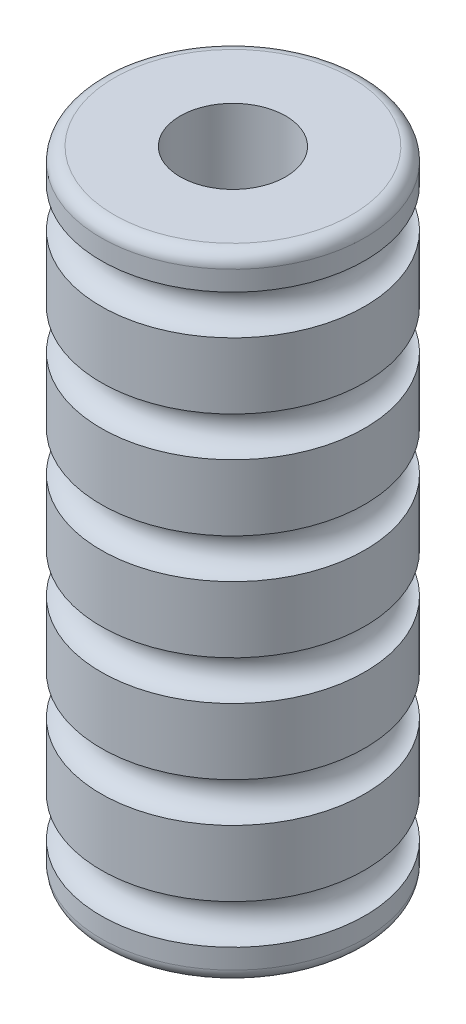
ISO-10303-21;
HEADER;
FILE_DESCRIPTION(('STEP AP214'),'2;1');
FILE_NAME('part.step','',(''),(''),'','','');
FILE_SCHEMA(('AUTOMOTIVE_DESIGN { 1 0 10303 214 1 1 1 1 }'));
ENDSEC;
DATA;
#1=APPLICATION_CONTEXT('core data for automotive mechanical design processes');
#2=APPLICATION_PROTOCOL_DEFINITION('international standard','automotive_design',2000,#1);
#3=PRODUCT_CONTEXT('',#1,'mechanical');
#4=PRODUCT('Part','Part','',(#3));
#5=PRODUCT_RELATED_PRODUCT_CATEGORY('part','',(#4));
#6=PRODUCT_DEFINITION_FORMATION('','',#4);
#7=PRODUCT_DEFINITION_CONTEXT('part definition',#1,'design');
#8=PRODUCT_DEFINITION('design','',#6,#7);
#9=PRODUCT_DEFINITION_SHAPE('','',#8);
#10=(LENGTH_UNIT() NAMED_UNIT(*) SI_UNIT(.MILLI.,.METRE.));
#11=(NAMED_UNIT(*) PLANE_ANGLE_UNIT() SI_UNIT($,.RADIAN.));
#12=(NAMED_UNIT(*) SI_UNIT($,.STERADIAN.) SOLID_ANGLE_UNIT());
#13=UNCERTAINTY_MEASURE_WITH_UNIT(LENGTH_MEASURE(1.E-05),#10,'distance_accuracy_value','');
#14=(GEOMETRIC_REPRESENTATION_CONTEXT(3) GLOBAL_UNCERTAINTY_ASSIGNED_CONTEXT((#13)) GLOBAL_UNIT_ASSIGNED_CONTEXT((#10,
#11,#12)) REPRESENTATION_CONTEXT('',''));
#15=CARTESIAN_POINT('',(0.,0.,0.));
#16=DIRECTION('',(0.,0.,1.));
#17=DIRECTION('',(1.,0.,0.));
#18=AXIS2_PLACEMENT_3D('',#15,#16,#17);
#19=CARTESIAN_POINT('',(0.,152.4,0.));
#20=DIRECTION('',(0.,1.,0.));
#21=DIRECTION('',(0.,0.,1.));
#22=AXIS2_PLACEMENT_3D('',#19,#20,#21);
#23=PLANE('',#22);
#24=CARTESIAN_POINT('',(0.,152.4,0.));
#25=DIRECTION('',(0.,1.,0.));
#26=DIRECTION('',(0.,0.,1.));
#27=AXIS2_PLACEMENT_3D('',#24,#25,#26);
#28=CIRCLE('',#27,12.7);
#29=CARTESIAN_POINT('',(0.,152.4,12.7));
#30=VERTEX_POINT('',#29);
#31=EDGE_CURVE('E86',#30,#30,#28,.F.);
#32=ORIENTED_EDGE('',*,*,#31,.T.);
#33=EDGE_LOOP('',(#32));
#34=FACE_BOUND('',#33,.T.);
#35=CARTESIAN_POINT('',(0.,152.4,0.));
#36=DIRECTION('',(0.,-1.,0.));
#37=DIRECTION('',(0.,0.,-1.));
#38=AXIS2_PLACEMENT_3D('',#35,#36,#37);
#39=CIRCLE('',#38,28.575);
#40=CARTESIAN_POINT('',(0.,152.4,-28.575));
#41=VERTEX_POINT('',#40);
#42=EDGE_CURVE('E10',#41,#41,#39,.T.);
#43=ORIENTED_EDGE('',*,*,#42,.F.);
#44=EDGE_LOOP('',(#43));
#45=FACE_BOUND('',#44,.T.);
#46=ADVANCED_FACE('F30',(#34,#45),#23,.T.);
#47=CARTESIAN_POINT('',(0.,149.225,0.));
#48=DIRECTION('',(0.,-1.,0.));
#49=DIRECTION('',(0.,0.,-1.));
#50=AXIS2_PLACEMENT_3D('',#47,#48,#49);
#51=TOROIDAL_SURFACE('',#50,28.575,3.17499999999999);
#52=ORIENTED_EDGE('',*,*,#42,.T.);
#53=EDGE_LOOP('',(#52));
#54=FACE_BOUND('',#53,.T.);
#55=CARTESIAN_POINT('',(0.,149.225,0.));
#56=DIRECTION('',(0.,-1.,0.));
#57=DIRECTION('',(0.,0.,-1.));
#58=AXIS2_PLACEMENT_3D('',#55,#56,#57);
#59=CIRCLE('',#58,31.75);
#60=CARTESIAN_POINT('',(0.,149.225,-31.75));
#61=VERTEX_POINT('',#60);
#62=EDGE_CURVE('E36',#61,#61,#59,.T.);
#63=ORIENTED_EDGE('',*,*,#62,.F.);
#64=EDGE_LOOP('',(#63));
#65=FACE_BOUND('',#64,.T.);
#66=ADVANCED_FACE('F112',(#54,#65),#51,.T.);
#67=CARTESIAN_POINT('',(0.,0.,0.));
#68=DIRECTION('',(0.,-1.,0.));
#69=DIRECTION('',(0.,0.,-1.));
#70=AXIS2_PLACEMENT_3D('',#67,#68,#69);
#71=CYLINDRICAL_SURFACE('',#70,31.75);
#72=ORIENTED_EDGE('',*,*,#62,.T.);
#73=EDGE_LOOP('',(#72));
#74=FACE_BOUND('',#73,.T.);
#75=CARTESIAN_POINT('',(0.,144.4625,0.));
#76=DIRECTION('',(0.,-1.,0.));
#77=DIRECTION('',(0.,0.,-1.));
#78=AXIS2_PLACEMENT_3D('',#75,#76,#77);
#79=CIRCLE('',#78,31.75);
#80=CARTESIAN_POINT('',(0.,144.4625,-31.75));
#81=VERTEX_POINT('',#80);
#82=EDGE_CURVE('E40',#81,#81,#79,.T.);
#83=ORIENTED_EDGE('',*,*,#82,.F.);
#84=EDGE_LOOP('',(#83));
#85=FACE_BOUND('',#84,.T.);
#86=ADVANCED_FACE('F117',(#74,#85),#71,.T.);
#87=CARTESIAN_POINT('',(0.,139.7,0.));
#88=DIRECTION('',(0.,-1.,0.));
#89=DIRECTION('',(0.,0.,-1.));
#90=AXIS2_PLACEMENT_3D('',#87,#88,#89);
#91=TOROIDAL_SURFACE('',#90,31.7499999999996,4.7625);
#92=ORIENTED_EDGE('',*,*,#82,.T.);
#93=EDGE_LOOP('',(#92));
#94=FACE_BOUND('',#93,.T.);
#95=CARTESIAN_POINT('',(0.,134.9375,0.));
#96=DIRECTION('',(0.,-1.,0.));
#97=DIRECTION('',(0.,0.,-1.));
#98=AXIS2_PLACEMENT_3D('',#95,#96,#97);
#99=CIRCLE('',#98,31.75);
#100=CARTESIAN_POINT('',(0.,134.9375,-31.75));
#101=VERTEX_POINT('',#100);
#102=EDGE_CURVE('E44',#101,#101,#99,.T.);
#103=ORIENTED_EDGE('',*,*,#102,.F.);
#104=EDGE_LOOP('',(#103));
#105=FACE_BOUND('',#104,.T.);
#106=ADVANCED_FACE('F243',(#94,#105),#91,.F.);
#107=CARTESIAN_POINT('',(0.,0.,0.));
#108=DIRECTION('',(0.,-1.,0.));
#109=DIRECTION('',(0.,0.,-1.));
#110=AXIS2_PLACEMENT_3D('',#107,#108,#109);
#111=CYLINDRICAL_SURFACE('',#110,31.75);
#112=ORIENTED_EDGE('',*,*,#102,.T.);
#113=EDGE_LOOP('',(#112));
#114=FACE_BOUND('',#113,.T.);
#115=CARTESIAN_POINT('',(0.,119.0625,0.));
#116=DIRECTION('',(0.,-1.,0.));
#117=DIRECTION('',(0.,0.,-1.));
#118=AXIS2_PLACEMENT_3D('',#115,#116,#117);
#119=CIRCLE('',#118,31.75);
#120=CARTESIAN_POINT('',(0.,119.0625,-31.75));
#121=VERTEX_POINT('',#120);
#122=EDGE_CURVE('E49',#121,#121,#119,.T.);
#123=ORIENTED_EDGE('',*,*,#122,.F.);
#124=EDGE_LOOP('',(#123));
#125=FACE_BOUND('',#124,.T.);
#126=ADVANCED_FACE('F233',(#114,#125),#111,.T.);
#127=CARTESIAN_POINT('',(0.,114.3,0.));
#128=DIRECTION('',(0.,-1.,0.));
#129=DIRECTION('',(0.,0.,-1.));
#130=AXIS2_PLACEMENT_3D('',#127,#128,#129);
#131=TOROIDAL_SURFACE('',#130,31.7499999999996,4.7625);
#132=ORIENTED_EDGE('',*,*,#122,.T.);
#133=EDGE_LOOP('',(#132));
#134=FACE_BOUND('',#133,.T.);
#135=CARTESIAN_POINT('',(0.,109.5375,0.));
#136=DIRECTION('',(0.,-1.,0.));
#137=DIRECTION('',(0.,0.,-1.));
#138=AXIS2_PLACEMENT_3D('',#135,#136,#137);
#139=CIRCLE('',#138,31.75);
#140=CARTESIAN_POINT('',(0.,109.5375,-31.75));
#141=VERTEX_POINT('',#140);
#142=EDGE_CURVE('E52',#141,#141,#139,.T.);
#143=ORIENTED_EDGE('',*,*,#142,.F.);
#144=EDGE_LOOP('',(#143));
#145=FACE_BOUND('',#144,.T.);
#146=ADVANCED_FACE('F223',(#134,#145),#131,.F.);
#147=CARTESIAN_POINT('',(0.,0.,0.));
#148=DIRECTION('',(0.,-1.,0.));
#149=DIRECTION('',(0.,0.,-1.));
#150=AXIS2_PLACEMENT_3D('',#147,#148,#149);
#151=CYLINDRICAL_SURFACE('',#150,31.75);
#152=ORIENTED_EDGE('',*,*,#142,.T.);
#153=EDGE_LOOP('',(#152));
#154=FACE_BOUND('',#153,.T.);
#155=CARTESIAN_POINT('',(0.,93.6625,0.));
#156=DIRECTION('',(0.,-1.,0.));
#157=DIRECTION('',(0.,0.,-1.));
#158=AXIS2_PLACEMENT_3D('',#155,#156,#157);
#159=CIRCLE('',#158,31.75);
#160=CARTESIAN_POINT('',(0.,93.6625,-31.75));
#161=VERTEX_POINT('',#160);
#162=EDGE_CURVE('E55',#161,#161,#159,.T.);
#163=ORIENTED_EDGE('',*,*,#162,.F.);
#164=EDGE_LOOP('',(#163));
#165=FACE_BOUND('',#164,.T.);
#166=ADVANCED_FACE('F213',(#154,#165),#151,.T.);
#167=CARTESIAN_POINT('',(0.,88.9,0.));
#168=DIRECTION('',(0.,-1.,0.));
#169=DIRECTION('',(0.,0.,-1.));
#170=AXIS2_PLACEMENT_3D('',#167,#168,#169);
#171=TOROIDAL_SURFACE('',#170,31.7499999999997,4.7625);
#172=ORIENTED_EDGE('',*,*,#162,.T.);
#173=EDGE_LOOP('',(#172));
#174=FACE_BOUND('',#173,.T.);
#175=CARTESIAN_POINT('',(0.,84.1375,0.));
#176=DIRECTION('',(0.,-1.,0.));
#177=DIRECTION('',(0.,0.,-1.));
#178=AXIS2_PLACEMENT_3D('',#175,#176,#177);
#179=CIRCLE('',#178,31.75);
#180=CARTESIAN_POINT('',(0.,84.1375,-31.75));
#181=VERTEX_POINT('',#180);
#182=EDGE_CURVE('E58',#181,#181,#179,.T.);
#183=ORIENTED_EDGE('',*,*,#182,.F.);
#184=EDGE_LOOP('',(#183));
#185=FACE_BOUND('',#184,.T.);
#186=ADVANCED_FACE('F203',(#174,#185),#171,.F.);
#187=CARTESIAN_POINT('',(0.,0.,0.));
#188=DIRECTION('',(0.,-1.,0.));
#189=DIRECTION('',(0.,0.,-1.));
#190=AXIS2_PLACEMENT_3D('',#187,#188,#189);
#191=CYLINDRICAL_SURFACE('',#190,31.75);
#192=ORIENTED_EDGE('',*,*,#182,.T.);
#193=EDGE_LOOP('',(#192));
#194=FACE_BOUND('',#193,.T.);
#195=CARTESIAN_POINT('',(0.,68.2625,0.));
#196=DIRECTION('',(0.,-1.,0.));
#197=DIRECTION('',(0.,0.,-1.));
#198=AXIS2_PLACEMENT_3D('',#195,#196,#197);
#199=CIRCLE('',#198,31.75);
#200=CARTESIAN_POINT('',(0.,68.2625,-31.75));
#201=VERTEX_POINT('',#200);
#202=EDGE_CURVE('E61',#201,#201,#199,.T.);
#203=ORIENTED_EDGE('',*,*,#202,.F.);
#204=EDGE_LOOP('',(#203));
#205=FACE_BOUND('',#204,.T.);
#206=ADVANCED_FACE('F193',(#194,#205),#191,.T.);
#207=CARTESIAN_POINT('',(0.,63.5,0.));
#208=DIRECTION('',(0.,-1.,0.));
#209=DIRECTION('',(0.,0.,-1.));
#210=AXIS2_PLACEMENT_3D('',#207,#208,#209);
#211=TOROIDAL_SURFACE('',#210,31.7499999999998,4.7625);
#212=ORIENTED_EDGE('',*,*,#202,.T.);
#213=EDGE_LOOP('',(#212));
#214=FACE_BOUND('',#213,.T.);
#215=CARTESIAN_POINT('',(0.,58.7375,0.));
#216=DIRECTION('',(0.,-1.,0.));
#217=DIRECTION('',(0.,0.,-1.));
#218=AXIS2_PLACEMENT_3D('',#215,#216,#217);
#219=CIRCLE('',#218,31.75);
#220=CARTESIAN_POINT('',(0.,58.7375,-31.75));
#221=VERTEX_POINT('',#220);
#222=EDGE_CURVE('E64',#221,#221,#219,.T.);
#223=ORIENTED_EDGE('',*,*,#222,.F.);
#224=EDGE_LOOP('',(#223));
#225=FACE_BOUND('',#224,.T.);
#226=ADVANCED_FACE('F183',(#214,#225),#211,.F.);
#227=CARTESIAN_POINT('',(0.,0.,0.));
#228=DIRECTION('',(0.,-1.,0.));
#229=DIRECTION('',(0.,0.,-1.));
#230=AXIS2_PLACEMENT_3D('',#227,#228,#229);
#231=CYLINDRICAL_SURFACE('',#230,31.75);
#232=ORIENTED_EDGE('',*,*,#222,.T.);
#233=EDGE_LOOP('',(#232));
#234=FACE_BOUND('',#233,.T.);
#235=CARTESIAN_POINT('',(0.,42.8625,0.));
#236=DIRECTION('',(0.,-1.,0.));
#237=DIRECTION('',(0.,0.,-1.));
#238=AXIS2_PLACEMENT_3D('',#235,#236,#237);
#239=CIRCLE('',#238,31.75);
#240=CARTESIAN_POINT('',(0.,42.8625,-31.75));
#241=VERTEX_POINT('',#240);
#242=EDGE_CURVE('E67',#241,#241,#239,.T.);
#243=ORIENTED_EDGE('',*,*,#242,.F.);
#244=EDGE_LOOP('',(#243));
#245=FACE_BOUND('',#244,.T.);
#246=ADVANCED_FACE('F173',(#234,#245),#231,.T.);
#247=CARTESIAN_POINT('',(0.,38.1,0.));
#248=DIRECTION('',(0.,-1.,0.));
#249=DIRECTION('',(0.,0.,-1.));
#250=AXIS2_PLACEMENT_3D('',#247,#248,#249);
#251=TOROIDAL_SURFACE('',#250,31.7499999999999,4.7625);
#252=ORIENTED_EDGE('',*,*,#242,.T.);
#253=EDGE_LOOP('',(#252));
#254=FACE_BOUND('',#253,.T.);
#255=CARTESIAN_POINT('',(0.,33.3375,0.));
#256=DIRECTION('',(0.,-1.,0.));
#257=DIRECTION('',(0.,0.,-1.));
#258=AXIS2_PLACEMENT_3D('',#255,#256,#257);
#259=CIRCLE('',#258,31.75);
#260=CARTESIAN_POINT('',(0.,33.3375,-31.75));
#261=VERTEX_POINT('',#260);
#262=EDGE_CURVE('E70',#261,#261,#259,.T.);
#263=ORIENTED_EDGE('',*,*,#262,.F.);
#264=EDGE_LOOP('',(#263));
#265=FACE_BOUND('',#264,.T.);
#266=ADVANCED_FACE('F163',(#254,#265),#251,.F.);
#267=CARTESIAN_POINT('',(0.,0.,0.));
#268=DIRECTION('',(0.,-1.,0.));
#269=DIRECTION('',(0.,0.,-1.));
#270=AXIS2_PLACEMENT_3D('',#267,#268,#269);
#271=CYLINDRICAL_SURFACE('',#270,31.75);
#272=ORIENTED_EDGE('',*,*,#262,.T.);
#273=EDGE_LOOP('',(#272));
#274=FACE_BOUND('',#273,.T.);
#275=CARTESIAN_POINT('',(0.,17.4625,0.));
#276=DIRECTION('',(0.,-1.,0.));
#277=DIRECTION('',(0.,0.,-1.));
#278=AXIS2_PLACEMENT_3D('',#275,#276,#277);
#279=CIRCLE('',#278,31.75);
#280=CARTESIAN_POINT('',(0.,17.4625,-31.75));
#281=VERTEX_POINT('',#280);
#282=EDGE_CURVE('E73',#281,#281,#279,.T.);
#283=ORIENTED_EDGE('',*,*,#282,.F.);
#284=EDGE_LOOP('',(#283));
#285=FACE_BOUND('',#284,.T.);
#286=ADVANCED_FACE('F153',(#274,#285),#271,.T.);
#287=CARTESIAN_POINT('',(0.,12.7,0.));
#288=DIRECTION('',(0.,-1.,0.));
#289=DIRECTION('',(0.,0.,-1.));
#290=AXIS2_PLACEMENT_3D('',#287,#288,#289);
#291=TOROIDAL_SURFACE('',#290,31.75,4.7625);
#292=ORIENTED_EDGE('',*,*,#282,.T.);
#293=EDGE_LOOP('',(#292));
#294=FACE_BOUND('',#293,.T.);
#295=CARTESIAN_POINT('',(0.,7.9375,0.));
#296=DIRECTION('',(0.,-1.,0.));
#297=DIRECTION('',(0.,0.,-1.));
#298=AXIS2_PLACEMENT_3D('',#295,#296,#297);
#299=CIRCLE('',#298,31.75);
#300=CARTESIAN_POINT('',(0.,7.9375,-31.75));
#301=VERTEX_POINT('',#300);
#302=EDGE_CURVE('E76',#301,#301,#299,.T.);
#303=ORIENTED_EDGE('',*,*,#302,.F.);
#304=EDGE_LOOP('',(#303));
#305=FACE_BOUND('',#304,.T.);
#306=ADVANCED_FACE('F108',(#294,#305),#291,.F.);
#307=CARTESIAN_POINT('',(0.,0.,0.));
#308=DIRECTION('',(0.,-1.,0.));
#309=DIRECTION('',(0.,0.,-1.));
#310=AXIS2_PLACEMENT_3D('',#307,#308,#309);
#311=CYLINDRICAL_SURFACE('',#310,31.75);
#312=ORIENTED_EDGE('',*,*,#302,.T.);
#313=EDGE_LOOP('',(#312));
#314=FACE_BOUND('',#313,.T.);
#315=CARTESIAN_POINT('',(0.,3.175,0.));
#316=DIRECTION('',(0.,-1.,0.));
#317=DIRECTION('',(0.,0.,-1.));
#318=AXIS2_PLACEMENT_3D('',#315,#316,#317);
#319=CIRCLE('',#318,31.75);
#320=CARTESIAN_POINT('',(0.,3.175,-31.75));
#321=VERTEX_POINT('',#320);
#322=EDGE_CURVE('E79',#321,#321,#319,.T.);
#323=ORIENTED_EDGE('',*,*,#322,.F.);
#324=EDGE_LOOP('',(#323));
#325=FACE_BOUND('',#324,.T.);
#326=ADVANCED_FACE('F102',(#314,#325),#311,.T.);
#327=CARTESIAN_POINT('',(0.,3.175,0.));
#328=DIRECTION('',(0.,-1.,0.));
#329=DIRECTION('',(0.,0.,-1.));
#330=AXIS2_PLACEMENT_3D('',#327,#328,#329);
#331=TOROIDAL_SURFACE('',#330,28.575,3.175);
#332=ORIENTED_EDGE('',*,*,#322,.T.);
#333=EDGE_LOOP('',(#332));
#334=FACE_BOUND('',#333,.T.);
#335=CARTESIAN_POINT('',(0.,0.,0.));
#336=DIRECTION('',(0.,-1.,0.));
#337=DIRECTION('',(0.,0.,-1.));
#338=AXIS2_PLACEMENT_3D('',#335,#336,#337);
#339=CIRCLE('',#338,28.575);
#340=CARTESIAN_POINT('',(0.,0.,-28.575));
#341=VERTEX_POINT('',#340);
#342=EDGE_CURVE('E82',#341,#341,#339,.T.);
#343=ORIENTED_EDGE('',*,*,#342,.F.);
#344=EDGE_LOOP('',(#343));
#345=FACE_BOUND('',#344,.T.);
#346=ADVANCED_FACE('F97',(#334,#345),#331,.T.);
#347=CARTESIAN_POINT('',(0.,0.,0.));
#348=DIRECTION('',(0.,-1.,0.));
#349=DIRECTION('',(0.,0.,-1.));
#350=AXIS2_PLACEMENT_3D('',#347,#348,#349);
#351=PLANE('',#350);
#352=CARTESIAN_POINT('',(0.,0.,0.));
#353=DIRECTION('',(0.,-1.,0.));
#354=DIRECTION('',(0.,0.,-1.));
#355=AXIS2_PLACEMENT_3D('',#352,#353,#354);
#356=CIRCLE('',#355,12.7);
#357=CARTESIAN_POINT('',(0.,0.,-12.7));
#358=VERTEX_POINT('',#357);
#359=EDGE_CURVE('E85',#358,#358,#356,.T.);
#360=ORIENTED_EDGE('',*,*,#359,.F.);
#361=EDGE_LOOP('',(#360));
#362=FACE_BOUND('',#361,.T.);
#363=ORIENTED_EDGE('',*,*,#342,.T.);
#364=EDGE_LOOP('',(#363));
#365=FACE_BOUND('',#364,.T.);
#366=ADVANCED_FACE('F94',(#362,#365),#351,.T.);
#367=CARTESIAN_POINT('',(0.,152.401,0.));
#368=DIRECTION('',(0.,-1.,0.));
#369=DIRECTION('',(0.,0.,-1.));
#370=AXIS2_PLACEMENT_3D('',#367,#368,#369);
#371=CYLINDRICAL_SURFACE('',#370,12.7);
#372=ORIENTED_EDGE('',*,*,#31,.F.);
#373=EDGE_LOOP('',(#372));
#374=FACE_BOUND('',#373,.T.);
#375=ORIENTED_EDGE('',*,*,#359,.T.);
#376=EDGE_LOOP('',(#375));
#377=FACE_BOUND('',#376,.T.);
#378=ADVANCED_FACE('F92',(#374,#377),#371,.F.);
#379=CLOSED_SHELL('',(#46,#66,#86,#106,#126,#146,#166,#186,#206,#226,#246,#266,#286,#306,#326,
#346,#366,#378));
#380=MANIFOLD_SOLID_BREP('B2',#379);
#381=ADVANCED_BREP_SHAPE_REPRESENTATION('',(#18,#380),#14);
#382=SHAPE_DEFINITION_REPRESENTATION(#9,#381);
ENDSEC;
END-ISO-10303-21;
